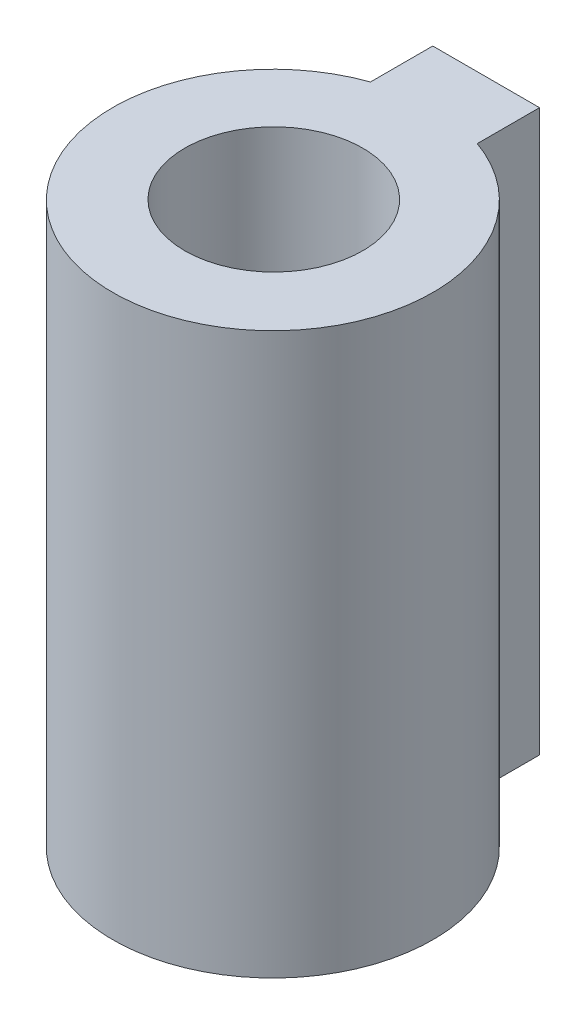
ISO-10303-21;
HEADER;
FILE_DESCRIPTION(('STEP AP214'),'2;1');
FILE_NAME('part.step','',(''),(''),'','','');
FILE_SCHEMA(('AUTOMOTIVE_DESIGN { 1 0 10303 214 1 1 1 1 }'));
ENDSEC;
DATA;
#1=APPLICATION_CONTEXT('core data for automotive mechanical design processes');
#2=APPLICATION_PROTOCOL_DEFINITION('international standard','automotive_design',2000,#1);
#3=PRODUCT_CONTEXT('',#1,'mechanical');
#4=PRODUCT('Part','Part','',(#3));
#5=PRODUCT_RELATED_PRODUCT_CATEGORY('part','',(#4));
#6=PRODUCT_DEFINITION_FORMATION('','',#4);
#7=PRODUCT_DEFINITION_CONTEXT('part definition',#1,'design');
#8=PRODUCT_DEFINITION('design','',#6,#7);
#9=PRODUCT_DEFINITION_SHAPE('','',#8);
#10=(LENGTH_UNIT() NAMED_UNIT(*) SI_UNIT(.MILLI.,.METRE.));
#11=(NAMED_UNIT(*) PLANE_ANGLE_UNIT() SI_UNIT($,.RADIAN.));
#12=(NAMED_UNIT(*) SI_UNIT($,.STERADIAN.) SOLID_ANGLE_UNIT());
#13=UNCERTAINTY_MEASURE_WITH_UNIT(LENGTH_MEASURE(1.E-05),#10,'distance_accuracy_value','');
#14=(GEOMETRIC_REPRESENTATION_CONTEXT(3) GLOBAL_UNCERTAINTY_ASSIGNED_CONTEXT((#13)) GLOBAL_UNIT_ASSIGNED_CONTEXT((#10,
#11,#12)) REPRESENTATION_CONTEXT('',''));
#15=CARTESIAN_POINT('',(0.,0.,0.));
#16=DIRECTION('',(0.,0.,1.));
#17=DIRECTION('',(1.,0.,0.));
#18=AXIS2_PLACEMENT_3D('',#15,#16,#17);
#19=CARTESIAN_POINT('',(-10.0484677556639,31.5,-7.21801242830869));
#20=DIRECTION('',(0.,-1.,0.));
#21=DIRECTION('',(0.,0.,-1.));
#22=AXIS2_PLACEMENT_3D('',#19,#20,#21);
#23=CYLINDRICAL_SURFACE('',#22,9.);
#24=CARTESIAN_POINT('',(-10.0484677556639,0.,-7.21801242830869));
#25=DIRECTION('',(0.,1.,0.));
#26=DIRECTION('',(0.,0.,1.));
#27=AXIS2_PLACEMENT_3D('',#24,#25,#26);
#28=CIRCLE('',#27,9.);
#29=CARTESIAN_POINT('',(-13.0484677556639,0.,-15.7032938025473));
#30=VERTEX_POINT('',#29);
#31=CARTESIAN_POINT('',(-7.04846775566391,0.,-15.7032938025473));
#32=VERTEX_POINT('',#31);
#33=EDGE_CURVE('E99',#30,#32,#28,.T.);
#34=ORIENTED_EDGE('',*,*,#33,.T.);
#35=DIRECTION('',(0.,-1.,0.));
#36=VECTOR('',#35,1.);
#37=CARTESIAN_POINT('',(-7.04846775566391,31.5,-15.7032938025473));
#38=LINE('',#37,#36);
#39=CARTESIAN_POINT('',(-7.04846775566391,31.5,-15.7032938025473));
#40=VERTEX_POINT('',#39);
#41=EDGE_CURVE('E11',#40,#32,#38,.T.);
#42=ORIENTED_EDGE('',*,*,#41,.F.);
#43=CARTESIAN_POINT('',(-10.0484677556639,31.5,-7.21801242830869));
#44=DIRECTION('',(0.,1.,0.));
#45=DIRECTION('',(0.,0.,1.));
#46=AXIS2_PLACEMENT_3D('',#43,#44,#45);
#47=CIRCLE('',#46,9.);
#48=CARTESIAN_POINT('',(-13.0484677556639,31.5,-15.7032938025473));
#49=VERTEX_POINT('',#48);
#50=EDGE_CURVE('E85',#49,#40,#47,.T.);
#51=ORIENTED_EDGE('',*,*,#50,.F.);
#52=DIRECTION('',(0.,-1.,0.));
#53=VECTOR('',#52,1.);
#54=CARTESIAN_POINT('',(-13.0484677556639,31.5,-15.7032938025473));
#55=LINE('',#54,#53);
#56=EDGE_CURVE('E52',#49,#30,#55,.T.);
#57=ORIENTED_EDGE('',*,*,#56,.T.);
#58=EDGE_LOOP('',(#34,#42,#51,#57));
#59=FACE_BOUND('',#58,.T.);
#60=ADVANCED_FACE('F36',(#59),#23,.T.);
#61=CARTESIAN_POINT('',(-7.04846775566391,31.5,0.));
#62=DIRECTION('',(-1.,0.,0.));
#63=DIRECTION('',(0.,0.,1.));
#64=AXIS2_PLACEMENT_3D('',#61,#62,#63);
#65=PLANE('',#64);
#66=DIRECTION('',(0.,0.,-1.));
#67=VECTOR('',#66,1.);
#68=CARTESIAN_POINT('',(-7.04846775566391,0.,0.));
#69=LINE('',#68,#67);
#70=CARTESIAN_POINT('',(-7.04846775566391,0.,-19.2032938025473));
#71=VERTEX_POINT('',#70);
#72=EDGE_CURVE('E90',#32,#71,#69,.T.);
#73=ORIENTED_EDGE('',*,*,#72,.T.);
#74=DIRECTION('',(0.,-1.,0.));
#75=VECTOR('',#74,1.);
#76=CARTESIAN_POINT('',(-7.04846775566391,31.5,-19.2032938025473));
#77=LINE('',#76,#75);
#78=CARTESIAN_POINT('',(-7.04846775566391,31.5,-19.2032938025473));
#79=VERTEX_POINT('',#78);
#80=EDGE_CURVE('E44',#79,#71,#77,.T.);
#81=ORIENTED_EDGE('',*,*,#80,.F.);
#82=DIRECTION('',(0.,0.,-1.));
#83=VECTOR('',#82,1.);
#84=CARTESIAN_POINT('',(-7.04846775566391,31.5,0.));
#85=LINE('',#84,#83);
#86=EDGE_CURVE('E78',#40,#79,#85,.T.);
#87=ORIENTED_EDGE('',*,*,#86,.F.);
#88=ORIENTED_EDGE('',*,*,#41,.T.);
#89=EDGE_LOOP('',(#73,#81,#87,#88));
#90=FACE_BOUND('',#89,.T.);
#91=ADVANCED_FACE('F89',(#90),#65,.F.);
#92=CARTESIAN_POINT('',(0.,31.5,-19.2032938025473));
#93=DIRECTION('',(0.,0.,1.));
#94=DIRECTION('',(1.,0.,0.));
#95=AXIS2_PLACEMENT_3D('',#92,#93,#94);
#96=PLANE('',#95);
#97=DIRECTION('',(-1.,0.,0.));
#98=VECTOR('',#97,1.);
#99=CARTESIAN_POINT('',(0.,0.,-19.2032938025473));
#100=LINE('',#99,#98);
#101=CARTESIAN_POINT('',(-13.0484677556639,0.,-19.2032938025473));
#102=VERTEX_POINT('',#101);
#103=EDGE_CURVE('E103',#71,#102,#100,.T.);
#104=ORIENTED_EDGE('',*,*,#103,.T.);
#105=DIRECTION('',(0.,-1.,0.));
#106=VECTOR('',#105,1.);
#107=CARTESIAN_POINT('',(-13.0484677556639,31.5,-19.2032938025473));
#108=LINE('',#107,#106);
#109=CARTESIAN_POINT('',(-13.0484677556639,31.5,-19.2032938025473));
#110=VERTEX_POINT('',#109);
#111=EDGE_CURVE('E67',#110,#102,#108,.T.);
#112=ORIENTED_EDGE('',*,*,#111,.F.);
#113=DIRECTION('',(-1.,0.,0.));
#114=VECTOR('',#113,1.);
#115=CARTESIAN_POINT('',(0.,31.5,-19.2032938025473));
#116=LINE('',#115,#114);
#117=EDGE_CURVE('E84',#79,#110,#116,.T.);
#118=ORIENTED_EDGE('',*,*,#117,.F.);
#119=ORIENTED_EDGE('',*,*,#80,.T.);
#120=EDGE_LOOP('',(#104,#112,#118,#119));
#121=FACE_BOUND('',#120,.T.);
#122=ADVANCED_FACE('F93',(#121),#96,.F.);
#123=CARTESIAN_POINT('',(-13.0484677556639,31.5,0.));
#124=DIRECTION('',(-1.,0.,0.));
#125=DIRECTION('',(0.,0.,1.));
#126=AXIS2_PLACEMENT_3D('',#123,#124,#125);
#127=PLANE('',#126);
#128=DIRECTION('',(0.,0.,-1.));
#129=VECTOR('',#128,1.);
#130=CARTESIAN_POINT('',(-13.0484677556639,0.,0.));
#131=LINE('',#130,#129);
#132=EDGE_CURVE('E105',#30,#102,#131,.T.);
#133=ORIENTED_EDGE('',*,*,#132,.F.);
#134=ORIENTED_EDGE('',*,*,#56,.F.);
#135=DIRECTION('',(0.,0.,-1.));
#136=VECTOR('',#135,1.);
#137=CARTESIAN_POINT('',(-13.0484677556639,31.5,0.));
#138=LINE('',#137,#136);
#139=EDGE_CURVE('E94',#49,#110,#138,.T.);
#140=ORIENTED_EDGE('',*,*,#139,.T.);
#141=ORIENTED_EDGE('',*,*,#111,.T.);
#142=EDGE_LOOP('',(#133,#134,#140,#141));
#143=FACE_BOUND('',#142,.T.);
#144=ADVANCED_FACE('F127',(#143),#127,.T.);
#145=CARTESIAN_POINT('',(0.,31.5,0.));
#146=DIRECTION('',(0.,1.,0.));
#147=DIRECTION('',(0.,0.,1.));
#148=AXIS2_PLACEMENT_3D('',#145,#146,#147);
#149=PLANE('',#148);
#150=CARTESIAN_POINT('',(-10.0484677556639,31.5,-7.27023953830748));
#151=DIRECTION('',(0.,1.,0.));
#152=DIRECTION('',(0.,0.,1.));
#153=AXIS2_PLACEMENT_3D('',#150,#151,#152);
#154=CIRCLE('',#153,5.);
#155=CARTESIAN_POINT('',(-10.0484677556639,31.5,-2.27023953830748));
#156=VERTEX_POINT('',#155);
#157=EDGE_CURVE('E111',#156,#156,#154,.T.);
#158=ORIENTED_EDGE('',*,*,#157,.F.);
#159=EDGE_LOOP('',(#158));
#160=FACE_BOUND('',#159,.T.);
#161=ORIENTED_EDGE('',*,*,#50,.T.);
#162=ORIENTED_EDGE('',*,*,#86,.T.);
#163=ORIENTED_EDGE('',*,*,#117,.T.);
#164=ORIENTED_EDGE('',*,*,#139,.F.);
#165=EDGE_LOOP('',(#161,#162,#163,#164));
#166=FACE_BOUND('',#165,.T.);
#167=ADVANCED_FACE('F81',(#160,#166),#149,.T.);
#168=CARTESIAN_POINT('',(0.,0.,0.));
#169=DIRECTION('',(0.,1.,0.));
#170=DIRECTION('',(0.,0.,1.));
#171=AXIS2_PLACEMENT_3D('',#168,#169,#170);
#172=PLANE('',#171);
#173=ORIENTED_EDGE('',*,*,#33,.F.);
#174=ORIENTED_EDGE('',*,*,#132,.T.);
#175=ORIENTED_EDGE('',*,*,#103,.F.);
#176=ORIENTED_EDGE('',*,*,#72,.F.);
#177=EDGE_LOOP('',(#173,#174,#175,#176));
#178=FACE_BOUND('',#177,.T.);
#179=ADVANCED_FACE('F122',(#178),#172,.F.);
#180=CARTESIAN_POINT('',(-10.0484677556639,6.5,-7.27023953830748));
#181=DIRECTION('',(0.,1.,0.));
#182=DIRECTION('',(0.,0.,1.));
#183=AXIS2_PLACEMENT_3D('',#180,#181,#182);
#184=CYLINDRICAL_SURFACE('',#183,5.);
#185=CARTESIAN_POINT('',(-10.0484677556639,6.5,-7.27023953830748));
#186=DIRECTION('',(0.,1.,0.));
#187=DIRECTION('',(0.,0.,1.));
#188=AXIS2_PLACEMENT_3D('',#185,#186,#187);
#189=CIRCLE('',#188,5.);
#190=CARTESIAN_POINT('',(-10.0484677556639,6.5,-2.27023953830748));
#191=VERTEX_POINT('',#190);
#192=EDGE_CURVE('E101',#191,#191,#189,.T.);
#193=ORIENTED_EDGE('',*,*,#192,.F.);
#194=EDGE_LOOP('',(#193));
#195=FACE_BOUND('',#194,.T.);
#196=ORIENTED_EDGE('',*,*,#157,.T.);
#197=EDGE_LOOP('',(#196));
#198=FACE_BOUND('',#197,.T.);
#199=ADVANCED_FACE('F119',(#195,#198),#184,.F.);
#200=CARTESIAN_POINT('',(-10.0484677556639,6.5,-7.27023953830748));
#201=DIRECTION('',(0.,1.,0.));
#202=DIRECTION('',(0.,0.,1.));
#203=AXIS2_PLACEMENT_3D('',#200,#201,#202);
#204=PLANE('',#203);
#205=ORIENTED_EDGE('',*,*,#192,.T.);
#206=EDGE_LOOP('',(#205));
#207=FACE_BOUND('',#206,.T.);
#208=ADVANCED_FACE('F117',(#207),#204,.T.);
#209=CLOSED_SHELL('',(#60,#91,#122,#144,#167,#179,#199,#208));
#210=MANIFOLD_SOLID_BREP('B2',#209);
#211=ADVANCED_BREP_SHAPE_REPRESENTATION('',(#18,#210),#14);
#212=SHAPE_DEFINITION_REPRESENTATION(#9,#211);
ENDSEC;
END-ISO-10303-21;
